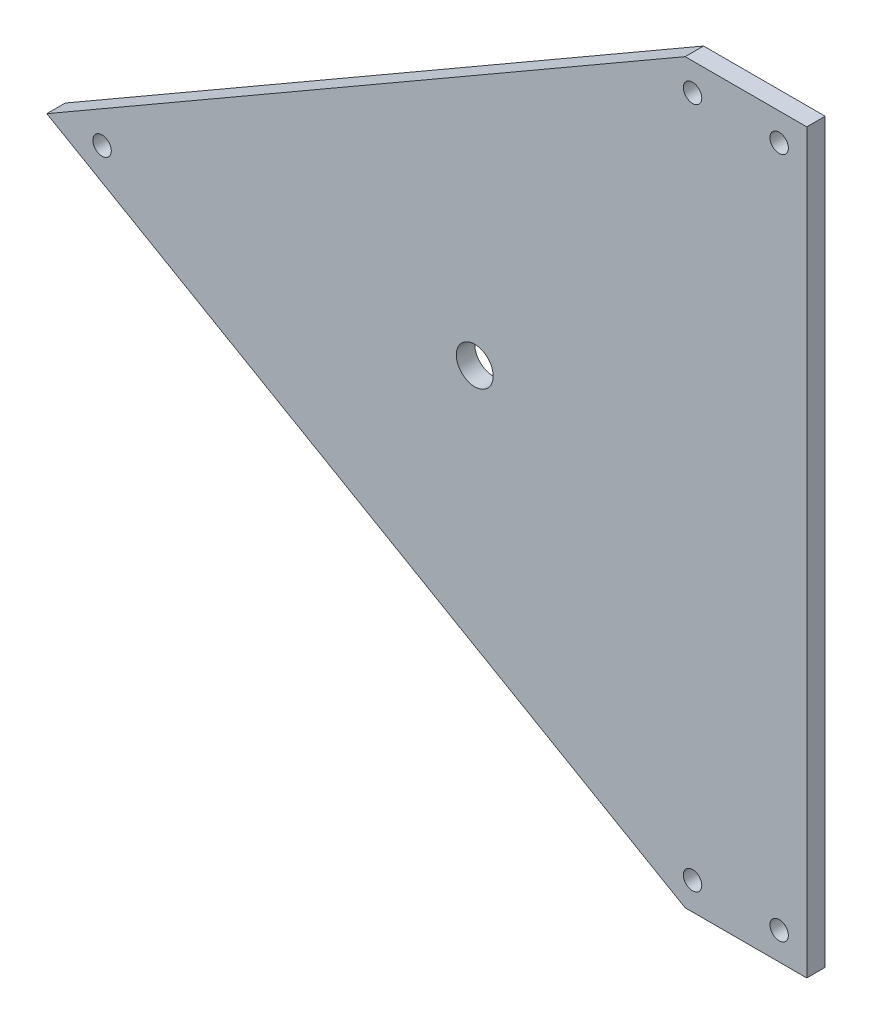
ISO-10303-21;
HEADER;
FILE_DESCRIPTION(('STEP AP214'),'2;1');
FILE_NAME('part.step','',(''),(''),'','','');
FILE_SCHEMA(('AUTOMOTIVE_DESIGN { 1 0 10303 214 1 1 1 1 }'));
ENDSEC;
DATA;
#1=APPLICATION_CONTEXT('core data for automotive mechanical design processes');
#2=APPLICATION_PROTOCOL_DEFINITION('international standard','automotive_design',2000,#1);
#3=PRODUCT_CONTEXT('',#1,'mechanical');
#4=PRODUCT('Part','Part','',(#3));
#5=PRODUCT_RELATED_PRODUCT_CATEGORY('part','',(#4));
#6=PRODUCT_DEFINITION_FORMATION('','',#4);
#7=PRODUCT_DEFINITION_CONTEXT('part definition',#1,'design');
#8=PRODUCT_DEFINITION('design','',#6,#7);
#9=PRODUCT_DEFINITION_SHAPE('','',#8);
#10=(LENGTH_UNIT() NAMED_UNIT(*) SI_UNIT(.MILLI.,.METRE.));
#11=(NAMED_UNIT(*) PLANE_ANGLE_UNIT() SI_UNIT($,.RADIAN.));
#12=(NAMED_UNIT(*) SI_UNIT($,.STERADIAN.) SOLID_ANGLE_UNIT());
#13=UNCERTAINTY_MEASURE_WITH_UNIT(LENGTH_MEASURE(1.E-05),#10,'distance_accuracy_value','');
#14=(GEOMETRIC_REPRESENTATION_CONTEXT(3) GLOBAL_UNCERTAINTY_ASSIGNED_CONTEXT((#13)) GLOBAL_UNIT_ASSIGNED_CONTEXT((#10,
#11,#12)) REPRESENTATION_CONTEXT('',''));
#15=CARTESIAN_POINT('',(0.,0.,0.));
#16=DIRECTION('',(0.,0.,1.));
#17=DIRECTION('',(1.,0.,0.));
#18=AXIS2_PLACEMENT_3D('',#15,#16,#17);
#19=CARTESIAN_POINT('',(0.,0.,5.));
#20=DIRECTION('',(0.,0.,-1.));
#21=DIRECTION('',(-1.,0.,0.));
#22=AXIS2_PLACEMENT_3D('',#19,#20,#21);
#23=PLANE('',#22);
#24=DIRECTION('',(-1.,0.,0.));
#25=VECTOR('',#24,1.);
#26=CARTESIAN_POINT('',(2.5,0.,5.));
#27=LINE('',#26,#25);
#28=CARTESIAN_POINT('',(2.5,0.,5.));
#29=VERTEX_POINT('',#28);
#30=CARTESIAN_POINT('',(-30.4999999999997,-8.74300631892311E-13,5.));
#31=VERTEX_POINT('',#30);
#32=EDGE_CURVE('E117',#29,#31,#27,.T.);
#33=ORIENTED_EDGE('',*,*,#32,.T.);
#34=DIRECTION('',(-0.866025403784441,-0.499999999999997,0.));
#35=VECTOR('',#34,1.);
#36=CARTESIAN_POINT('',(-30.4999999999997,-8.74300631892311E-13,5.));
#37=LINE('',#36,#35);
#38=CARTESIAN_POINT('',(-203.705080756888,-100.,5.));
#39=VERTEX_POINT('',#38);
#40=EDGE_CURVE('E84',#31,#39,#37,.T.);
#41=ORIENTED_EDGE('',*,*,#40,.T.);
#42=DIRECTION('',(0.866025403784439,-0.499999999999999,0.));
#43=VECTOR('',#42,1.);
#44=CARTESIAN_POINT('',(-203.705080756888,-100.,5.));
#45=LINE('',#44,#43);
#46=CARTESIAN_POINT('',(-30.5,-200.,5.));
#47=VERTEX_POINT('',#46);
#48=EDGE_CURVE('E88',#39,#47,#45,.T.);
#49=ORIENTED_EDGE('',*,*,#48,.T.);
#50=DIRECTION('',(1.,0.,0.));
#51=VECTOR('',#50,1.);
#52=CARTESIAN_POINT('',(-30.5,-200.,5.));
#53=LINE('',#52,#51);
#54=CARTESIAN_POINT('',(2.50000000000002,-200.,5.));
#55=VERTEX_POINT('',#54);
#56=EDGE_CURVE('E92',#47,#55,#53,.T.);
#57=ORIENTED_EDGE('',*,*,#56,.T.);
#58=DIRECTION('',(0.,1.,0.));
#59=VECTOR('',#58,1.);
#60=CARTESIAN_POINT('',(2.50000000000002,-200.,5.));
#61=LINE('',#60,#59);
#62=EDGE_CURVE('E50',#55,#29,#61,.T.);
#63=ORIENTED_EDGE('',*,*,#62,.T.);
#64=EDGE_LOOP('',(#33,#41,#49,#57,#63));
#65=FACE_BOUND('',#64,.T.);
#66=CARTESIAN_POINT('',(-188.705080756888,-99.9999999999999,5.));
#67=DIRECTION('',(0.,0.,1.));
#68=DIRECTION('',(1.,0.,0.));
#69=AXIS2_PLACEMENT_3D('',#66,#67,#68);
#70=CIRCLE('',#69,2.50000000000017);
#71=CARTESIAN_POINT('',(-186.205080756888,-99.9999999999999,5.));
#72=VERTEX_POINT('',#71);
#73=EDGE_CURVE('E112',#72,#72,#70,.T.);
#74=ORIENTED_EDGE('',*,*,#73,.F.);
#75=EDGE_LOOP('',(#74));
#76=FACE_BOUND('',#75,.T.);
#77=CARTESIAN_POINT('',(-28.4903810567665,-7.50000000000001,5.));
#78=DIRECTION('',(0.,0.,1.));
#79=DIRECTION('',(1.,0.,0.));
#80=AXIS2_PLACEMENT_3D('',#77,#78,#79);
#81=CIRCLE('',#80,2.5);
#82=CARTESIAN_POINT('',(-25.9903810567665,-7.50000000000001,5.));
#83=VERTEX_POINT('',#82);
#84=EDGE_CURVE('E196',#83,#83,#81,.T.);
#85=ORIENTED_EDGE('',*,*,#84,.F.);
#86=EDGE_LOOP('',(#85));
#87=FACE_BOUND('',#86,.T.);
#88=CARTESIAN_POINT('',(-4.99999999999998,-7.50000000000001,5.));
#89=DIRECTION('',(0.,0.,1.));
#90=DIRECTION('',(1.,0.,0.));
#91=AXIS2_PLACEMENT_3D('',#88,#89,#90);
#92=CIRCLE('',#91,2.5);
#93=CARTESIAN_POINT('',(-2.49999999999997,-7.50000000000001,5.));
#94=VERTEX_POINT('',#93);
#95=EDGE_CURVE('E190',#94,#94,#92,.T.);
#96=ORIENTED_EDGE('',*,*,#95,.F.);
#97=EDGE_LOOP('',(#96));
#98=FACE_BOUND('',#97,.T.);
#99=CARTESIAN_POINT('',(-4.99999999999998,-192.5,5.));
#100=DIRECTION('',(0.,0.,1.));
#101=DIRECTION('',(1.,0.,0.));
#102=AXIS2_PLACEMENT_3D('',#99,#100,#101);
#103=CIRCLE('',#102,2.5);
#104=CARTESIAN_POINT('',(-2.49999999999997,-192.5,5.));
#105=VERTEX_POINT('',#104);
#106=EDGE_CURVE('E184',#105,#105,#103,.T.);
#107=ORIENTED_EDGE('',*,*,#106,.F.);
#108=EDGE_LOOP('',(#107));
#109=FACE_BOUND('',#108,.T.);
#110=CARTESIAN_POINT('',(-28.4903810567665,-192.5,5.));
#111=DIRECTION('',(0.,0.,1.));
#112=DIRECTION('',(1.,0.,0.));
#113=AXIS2_PLACEMENT_3D('',#110,#111,#112);
#114=CIRCLE('',#113,2.5);
#115=CARTESIAN_POINT('',(-25.9903810567665,-192.5,5.));
#116=VERTEX_POINT('',#115);
#117=EDGE_CURVE('E178',#116,#116,#114,.T.);
#118=ORIENTED_EDGE('',*,*,#117,.F.);
#119=EDGE_LOOP('',(#118));
#120=FACE_BOUND('',#119,.T.);
#121=CARTESIAN_POINT('',(-87.5867296048686,-101.122883886422,5.));
#122=DIRECTION('',(0.,0.,1.));
#123=DIRECTION('',(1.,0.,0.));
#124=AXIS2_PLACEMENT_3D('',#121,#122,#123);
#125=CIRCLE('',#124,5.00000000000001);
#126=CARTESIAN_POINT('',(-82.5867296048685,-101.122883886422,5.));
#127=VERTEX_POINT('',#126);
#128=EDGE_CURVE('E169',#127,#127,#125,.T.);
#129=ORIENTED_EDGE('',*,*,#128,.F.);
#130=EDGE_LOOP('',(#129));
#131=FACE_BOUND('',#130,.T.);
#132=ADVANCED_FACE('F33',(#65,#76,#87,#98,#109,#120,#131),#23,.F.);
#133=CARTESIAN_POINT('',(0.,0.,0.));
#134=DIRECTION('',(0.,0.,-1.));
#135=DIRECTION('',(-1.,0.,0.));
#136=AXIS2_PLACEMENT_3D('',#133,#134,#135);
#137=PLANE('',#136);
#138=CARTESIAN_POINT('',(-28.4903810567665,-192.5,0.));
#139=DIRECTION('',(0.,0.,1.));
#140=DIRECTION('',(1.,0.,0.));
#141=AXIS2_PLACEMENT_3D('',#138,#139,#140);
#142=CIRCLE('',#141,2.5);
#143=CARTESIAN_POINT('',(-25.9903810567665,-192.5,0.));
#144=VERTEX_POINT('',#143);
#145=EDGE_CURVE('E175',#144,#144,#142,.T.);
#146=ORIENTED_EDGE('',*,*,#145,.T.);
#147=EDGE_LOOP('',(#146));
#148=FACE_BOUND('',#147,.T.);
#149=CARTESIAN_POINT('',(-4.99999999999998,-7.50000000000001,0.));
#150=DIRECTION('',(0.,0.,1.));
#151=DIRECTION('',(1.,0.,0.));
#152=AXIS2_PLACEMENT_3D('',#149,#150,#151);
#153=CIRCLE('',#152,2.5);
#154=CARTESIAN_POINT('',(-2.49999999999997,-7.50000000000001,0.));
#155=VERTEX_POINT('',#154);
#156=EDGE_CURVE('E187',#155,#155,#153,.T.);
#157=ORIENTED_EDGE('',*,*,#156,.T.);
#158=EDGE_LOOP('',(#157));
#159=FACE_BOUND('',#158,.T.);
#160=CARTESIAN_POINT('',(-188.705080756888,-99.9999999999999,0.));
#161=DIRECTION('',(0.,0.,1.));
#162=DIRECTION('',(1.,0.,0.));
#163=AXIS2_PLACEMENT_3D('',#160,#161,#162);
#164=CIRCLE('',#163,2.50000000000017);
#165=CARTESIAN_POINT('',(-186.205080756888,-99.9999999999999,0.));
#166=VERTEX_POINT('',#165);
#167=EDGE_CURVE('E199',#166,#166,#164,.T.);
#168=ORIENTED_EDGE('',*,*,#167,.T.);
#169=EDGE_LOOP('',(#168));
#170=FACE_BOUND('',#169,.T.);
#171=DIRECTION('',(-1.,0.,0.));
#172=VECTOR('',#171,1.);
#173=CARTESIAN_POINT('',(2.5,0.,0.));
#174=LINE('',#173,#172);
#175=CARTESIAN_POINT('',(2.5,0.,0.));
#176=VERTEX_POINT('',#175);
#177=CARTESIAN_POINT('',(-30.4999999999997,-8.74300631892311E-13,0.));
#178=VERTEX_POINT('',#177);
#179=EDGE_CURVE('E108',#176,#178,#174,.T.);
#180=ORIENTED_EDGE('',*,*,#179,.F.);
#181=DIRECTION('',(0.,1.,0.));
#182=VECTOR('',#181,1.);
#183=CARTESIAN_POINT('',(2.50000000000002,-200.,0.));
#184=LINE('',#183,#182);
#185=CARTESIAN_POINT('',(2.50000000000002,-200.,0.));
#186=VERTEX_POINT('',#185);
#187=EDGE_CURVE('E76',#186,#176,#184,.T.);
#188=ORIENTED_EDGE('',*,*,#187,.F.);
#189=DIRECTION('',(1.,0.,0.));
#190=VECTOR('',#189,1.);
#191=CARTESIAN_POINT('',(-30.5,-200.,0.));
#192=LINE('',#191,#190);
#193=CARTESIAN_POINT('',(-30.5,-200.,0.));
#194=VERTEX_POINT('',#193);
#195=EDGE_CURVE('E70',#194,#186,#192,.T.);
#196=ORIENTED_EDGE('',*,*,#195,.F.);
#197=DIRECTION('',(0.866025403784439,-0.499999999999999,0.));
#198=VECTOR('',#197,1.);
#199=CARTESIAN_POINT('',(-203.705080756888,-100.,0.));
#200=LINE('',#199,#198);
#201=CARTESIAN_POINT('',(-203.705080756888,-100.,0.));
#202=VERTEX_POINT('',#201);
#203=EDGE_CURVE('E99',#202,#194,#200,.T.);
#204=ORIENTED_EDGE('',*,*,#203,.F.);
#205=DIRECTION('',(-0.866025403784441,-0.499999999999997,0.));
#206=VECTOR('',#205,1.);
#207=CARTESIAN_POINT('',(-30.4999999999997,-8.74300631892311E-13,0.));
#208=LINE('',#207,#206);
#209=EDGE_CURVE('E111',#178,#202,#208,.T.);
#210=ORIENTED_EDGE('',*,*,#209,.F.);
#211=EDGE_LOOP('',(#180,#188,#196,#204,#210));
#212=FACE_BOUND('',#211,.T.);
#213=CARTESIAN_POINT('',(-28.4903810567665,-7.50000000000001,0.));
#214=DIRECTION('',(0.,0.,1.));
#215=DIRECTION('',(1.,0.,0.));
#216=AXIS2_PLACEMENT_3D('',#213,#214,#215);
#217=CIRCLE('',#216,2.5);
#218=CARTESIAN_POINT('',(-25.9903810567665,-7.50000000000001,0.));
#219=VERTEX_POINT('',#218);
#220=EDGE_CURVE('E193',#219,#219,#217,.T.);
#221=ORIENTED_EDGE('',*,*,#220,.T.);
#222=EDGE_LOOP('',(#221));
#223=FACE_BOUND('',#222,.T.);
#224=CARTESIAN_POINT('',(-4.99999999999998,-192.5,0.));
#225=DIRECTION('',(0.,0.,1.));
#226=DIRECTION('',(1.,0.,0.));
#227=AXIS2_PLACEMENT_3D('',#224,#225,#226);
#228=CIRCLE('',#227,2.5);
#229=CARTESIAN_POINT('',(-2.49999999999997,-192.5,0.));
#230=VERTEX_POINT('',#229);
#231=EDGE_CURVE('E181',#230,#230,#228,.T.);
#232=ORIENTED_EDGE('',*,*,#231,.T.);
#233=EDGE_LOOP('',(#232));
#234=FACE_BOUND('',#233,.T.);
#235=CARTESIAN_POINT('',(-87.5867296048686,-101.122883886422,0.));
#236=DIRECTION('',(0.,0.,1.));
#237=DIRECTION('',(1.,0.,0.));
#238=AXIS2_PLACEMENT_3D('',#235,#236,#237);
#239=CIRCLE('',#238,5.00000000000001);
#240=CARTESIAN_POINT('',(-82.5867296048685,-101.122883886422,0.));
#241=VERTEX_POINT('',#240);
#242=EDGE_CURVE('E172',#241,#241,#239,.T.);
#243=ORIENTED_EDGE('',*,*,#242,.T.);
#244=EDGE_LOOP('',(#243));
#245=FACE_BOUND('',#244,.T.);
#246=ADVANCED_FACE('F121',(#148,#159,#170,#212,#223,#234,#245),#137,.T.);
#247=CARTESIAN_POINT('',(2.5,0.,5.));
#248=DIRECTION('',(0.,-1.,0.));
#249=DIRECTION('',(1.,0.,0.));
#250=AXIS2_PLACEMENT_3D('',#247,#248,#249);
#251=PLANE('',#250);
#252=ORIENTED_EDGE('',*,*,#179,.T.);
#253=DIRECTION('',(0.,0.,-1.));
#254=VECTOR('',#253,1.);
#255=CARTESIAN_POINT('',(-30.4999999999997,-8.74300631892311E-13,5.));
#256=LINE('',#255,#254);
#257=EDGE_CURVE('E11',#31,#178,#256,.T.);
#258=ORIENTED_EDGE('',*,*,#257,.F.);
#259=ORIENTED_EDGE('',*,*,#32,.F.);
#260=DIRECTION('',(0.,0.,-1.));
#261=VECTOR('',#260,1.);
#262=CARTESIAN_POINT('',(2.5,0.,5.));
#263=LINE('',#262,#261);
#264=EDGE_CURVE('E104',#29,#176,#263,.T.);
#265=ORIENTED_EDGE('',*,*,#264,.T.);
#266=EDGE_LOOP('',(#252,#258,#259,#265));
#267=FACE_BOUND('',#266,.T.);
#268=ADVANCED_FACE('F35',(#267),#251,.F.);
#269=CARTESIAN_POINT('',(-30.4999999999997,-8.74300631892311E-13,5.));
#270=DIRECTION('',(0.499999999999997,-0.866025403784441,0.));
#271=DIRECTION('',(0.866025403784441,0.499999999999997,0.));
#272=AXIS2_PLACEMENT_3D('',#269,#270,#271);
#273=PLANE('',#272);
#274=ORIENTED_EDGE('',*,*,#209,.T.);
#275=DIRECTION('',(0.,0.,-1.));
#276=VECTOR('',#275,1.);
#277=CARTESIAN_POINT('',(-203.705080756888,-100.,5.));
#278=LINE('',#277,#276);
#279=EDGE_CURVE('E42',#39,#202,#278,.T.);
#280=ORIENTED_EDGE('',*,*,#279,.F.);
#281=ORIENTED_EDGE('',*,*,#40,.F.);
#282=ORIENTED_EDGE('',*,*,#257,.T.);
#283=EDGE_LOOP('',(#274,#280,#281,#282));
#284=FACE_BOUND('',#283,.T.);
#285=ADVANCED_FACE('F268',(#284),#273,.F.);
#286=CARTESIAN_POINT('',(-203.705080756888,-100.,5.));
#287=DIRECTION('',(0.499999999999999,0.866025403784439,0.));
#288=DIRECTION('',(-0.866025403784439,0.499999999999999,0.));
#289=AXIS2_PLACEMENT_3D('',#286,#287,#288);
#290=PLANE('',#289);
#291=ORIENTED_EDGE('',*,*,#203,.T.);
#292=DIRECTION('',(0.,0.,-1.));
#293=VECTOR('',#292,1.);
#294=CARTESIAN_POINT('',(-30.5,-200.,5.));
#295=LINE('',#294,#293);
#296=EDGE_CURVE('E96',#47,#194,#295,.T.);
#297=ORIENTED_EDGE('',*,*,#296,.F.);
#298=ORIENTED_EDGE('',*,*,#48,.F.);
#299=ORIENTED_EDGE('',*,*,#279,.T.);
#300=EDGE_LOOP('',(#291,#297,#298,#299));
#301=FACE_BOUND('',#300,.T.);
#302=ADVANCED_FACE('F97',(#301),#290,.F.);
#303=CARTESIAN_POINT('',(-30.5,-200.,5.));
#304=DIRECTION('',(0.,1.,0.));
#305=DIRECTION('',(0.,0.,1.));
#306=AXIS2_PLACEMENT_3D('',#303,#304,#305);
#307=PLANE('',#306);
#308=ORIENTED_EDGE('',*,*,#195,.T.);
#309=DIRECTION('',(0.,0.,-1.));
#310=VECTOR('',#309,1.);
#311=CARTESIAN_POINT('',(2.50000000000002,-200.,5.));
#312=LINE('',#311,#310);
#313=EDGE_CURVE('E100',#55,#186,#312,.T.);
#314=ORIENTED_EDGE('',*,*,#313,.F.);
#315=ORIENTED_EDGE('',*,*,#56,.F.);
#316=ORIENTED_EDGE('',*,*,#296,.T.);
#317=EDGE_LOOP('',(#308,#314,#315,#316));
#318=FACE_BOUND('',#317,.T.);
#319=ADVANCED_FACE('F102',(#318),#307,.F.);
#320=CARTESIAN_POINT('',(2.50000000000002,-200.,5.));
#321=DIRECTION('',(-1.,0.,0.));
#322=DIRECTION('',(0.,-1.,0.));
#323=AXIS2_PLACEMENT_3D('',#320,#321,#322);
#324=PLANE('',#323);
#325=ORIENTED_EDGE('',*,*,#187,.T.);
#326=ORIENTED_EDGE('',*,*,#264,.F.);
#327=ORIENTED_EDGE('',*,*,#62,.F.);
#328=ORIENTED_EDGE('',*,*,#313,.T.);
#329=EDGE_LOOP('',(#325,#326,#327,#328));
#330=FACE_BOUND('',#329,.T.);
#331=ADVANCED_FACE('F126',(#330),#324,.F.);
#332=CARTESIAN_POINT('',(-188.705080756888,-99.9999999999999,5.));
#333=DIRECTION('',(0.,0.,-1.));
#334=DIRECTION('',(-1.,0.,0.));
#335=AXIS2_PLACEMENT_3D('',#332,#333,#334);
#336=CYLINDRICAL_SURFACE('',#335,2.50000000000017);
#337=ORIENTED_EDGE('',*,*,#73,.T.);
#338=EDGE_LOOP('',(#337));
#339=FACE_BOUND('',#338,.T.);
#340=ORIENTED_EDGE('',*,*,#167,.F.);
#341=EDGE_LOOP('',(#340));
#342=FACE_BOUND('',#341,.T.);
#343=ADVANCED_FACE('F128',(#339,#342),#336,.F.);
#344=CARTESIAN_POINT('',(-28.4903810567665,-7.50000000000001,5.));
#345=DIRECTION('',(0.,0.,-1.));
#346=DIRECTION('',(-1.,0.,0.));
#347=AXIS2_PLACEMENT_3D('',#344,#345,#346);
#348=CYLINDRICAL_SURFACE('',#347,2.5);
#349=ORIENTED_EDGE('',*,*,#84,.T.);
#350=EDGE_LOOP('',(#349));
#351=FACE_BOUND('',#350,.T.);
#352=ORIENTED_EDGE('',*,*,#220,.F.);
#353=EDGE_LOOP('',(#352));
#354=FACE_BOUND('',#353,.T.);
#355=ADVANCED_FACE('F134',(#351,#354),#348,.F.);
#356=CARTESIAN_POINT('',(-4.99999999999998,-7.50000000000001,5.));
#357=DIRECTION('',(0.,0.,-1.));
#358=DIRECTION('',(-1.,0.,0.));
#359=AXIS2_PLACEMENT_3D('',#356,#357,#358);
#360=CYLINDRICAL_SURFACE('',#359,2.5);
#361=ORIENTED_EDGE('',*,*,#95,.T.);
#362=EDGE_LOOP('',(#361));
#363=FACE_BOUND('',#362,.T.);
#364=ORIENTED_EDGE('',*,*,#156,.F.);
#365=EDGE_LOOP('',(#364));
#366=FACE_BOUND('',#365,.T.);
#367=ADVANCED_FACE('F148',(#363,#366),#360,.F.);
#368=CARTESIAN_POINT('',(-4.99999999999998,-192.5,5.));
#369=DIRECTION('',(0.,0.,-1.));
#370=DIRECTION('',(-1.,0.,0.));
#371=AXIS2_PLACEMENT_3D('',#368,#369,#370);
#372=CYLINDRICAL_SURFACE('',#371,2.5);
#373=ORIENTED_EDGE('',*,*,#106,.T.);
#374=EDGE_LOOP('',(#373));
#375=FACE_BOUND('',#374,.T.);
#376=ORIENTED_EDGE('',*,*,#231,.F.);
#377=EDGE_LOOP('',(#376));
#378=FACE_BOUND('',#377,.T.);
#379=ADVANCED_FACE('F152',(#375,#378),#372,.F.);
#380=CARTESIAN_POINT('',(-28.4903810567665,-192.5,5.));
#381=DIRECTION('',(0.,0.,-1.));
#382=DIRECTION('',(-1.,0.,0.));
#383=AXIS2_PLACEMENT_3D('',#380,#381,#382);
#384=CYLINDRICAL_SURFACE('',#383,2.5);
#385=ORIENTED_EDGE('',*,*,#117,.T.);
#386=EDGE_LOOP('',(#385));
#387=FACE_BOUND('',#386,.T.);
#388=ORIENTED_EDGE('',*,*,#145,.F.);
#389=EDGE_LOOP('',(#388));
#390=FACE_BOUND('',#389,.T.);
#391=ADVANCED_FACE('F156',(#387,#390),#384,.F.);
#392=CARTESIAN_POINT('',(-87.5867296048686,-101.122883886422,5.));
#393=DIRECTION('',(0.,0.,-1.));
#394=DIRECTION('',(-1.,0.,0.));
#395=AXIS2_PLACEMENT_3D('',#392,#393,#394);
#396=CYLINDRICAL_SURFACE('',#395,5.00000000000001);
#397=ORIENTED_EDGE('',*,*,#128,.T.);
#398=EDGE_LOOP('',(#397));
#399=FACE_BOUND('',#398,.T.);
#400=ORIENTED_EDGE('',*,*,#242,.F.);
#401=EDGE_LOOP('',(#400));
#402=FACE_BOUND('',#401,.T.);
#403=ADVANCED_FACE('F160',(#399,#402),#396,.F.);
#404=CLOSED_SHELL('',(#132,#246,#268,#285,#302,#319,#331,#343,#355,#367,#379,#391,#403));
#405=MANIFOLD_SOLID_BREP('B2',#404);
#406=ADVANCED_BREP_SHAPE_REPRESENTATION('',(#18,#405),#14);
#407=SHAPE_DEFINITION_REPRESENTATION(#9,#406);
ENDSEC;
END-ISO-10303-21;
